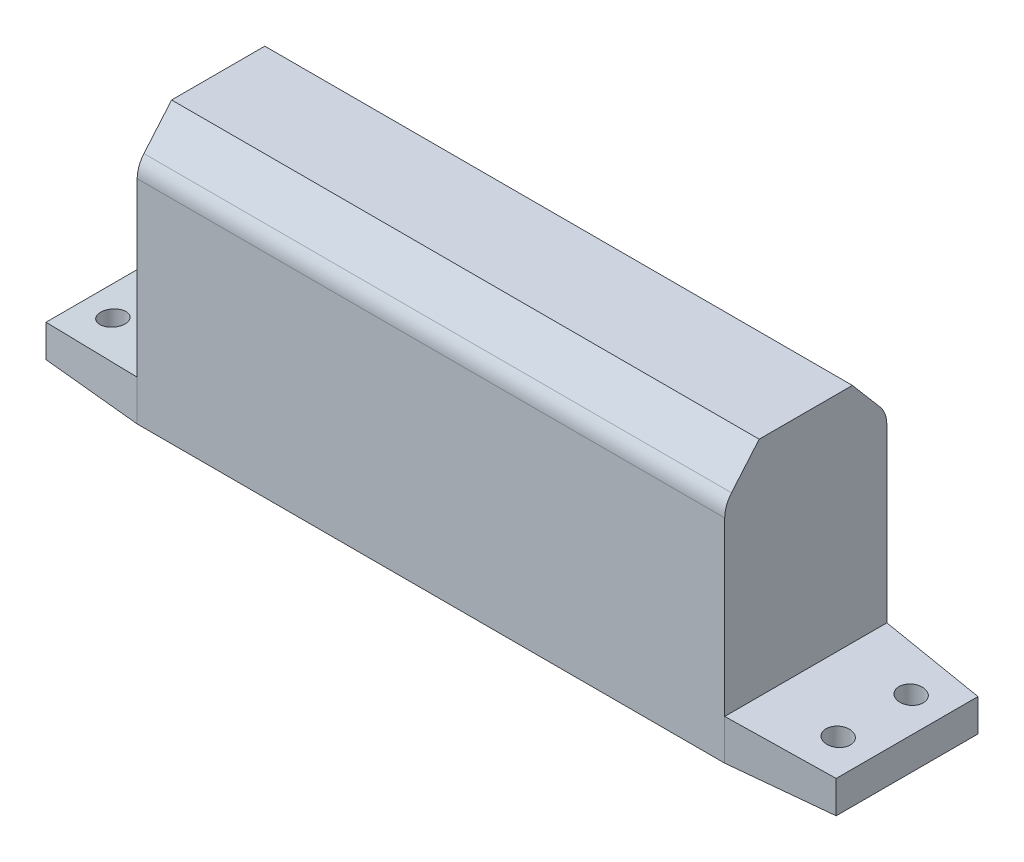
ISO-10303-21;
HEADER;
FILE_DESCRIPTION(('STEP AP214'),'2;1');
FILE_NAME('part.step','',(''),(''),'','','');
FILE_SCHEMA(('AUTOMOTIVE_DESIGN { 1 0 10303 214 1 1 1 1 }'));
ENDSEC;
DATA;
#1=APPLICATION_CONTEXT('core data for automotive mechanical design processes');
#2=APPLICATION_PROTOCOL_DEFINITION('international standard','automotive_design',2000,#1);
#3=PRODUCT_CONTEXT('',#1,'mechanical');
#4=PRODUCT('Part','Part','',(#3));
#5=PRODUCT_RELATED_PRODUCT_CATEGORY('part','',(#4));
#6=PRODUCT_DEFINITION_FORMATION('','',#4);
#7=PRODUCT_DEFINITION_CONTEXT('part definition',#1,'design');
#8=PRODUCT_DEFINITION('design','',#6,#7);
#9=PRODUCT_DEFINITION_SHAPE('','',#8);
#10=(LENGTH_UNIT() NAMED_UNIT(*) SI_UNIT(.MILLI.,.METRE.));
#11=(NAMED_UNIT(*) PLANE_ANGLE_UNIT() SI_UNIT($,.RADIAN.));
#12=(NAMED_UNIT(*) SI_UNIT($,.STERADIAN.) SOLID_ANGLE_UNIT());
#13=UNCERTAINTY_MEASURE_WITH_UNIT(LENGTH_MEASURE(1.E-05),#10,'distance_accuracy_value','');
#14=(GEOMETRIC_REPRESENTATION_CONTEXT(3) GLOBAL_UNCERTAINTY_ASSIGNED_CONTEXT((#13)) GLOBAL_UNIT_ASSIGNED_CONTEXT((#10,
#11,#12)) REPRESENTATION_CONTEXT('',''));
#15=CARTESIAN_POINT('',(0.,0.,0.));
#16=DIRECTION('',(0.,0.,1.));
#17=DIRECTION('',(1.,0.,0.));
#18=AXIS2_PLACEMENT_3D('',#15,#16,#17);
#19=CARTESIAN_POINT('',(0.,22.5,-22.));
#20=DIRECTION('',(0.,0.,-1.));
#21=DIRECTION('',(-1.,0.,0.));
#22=AXIS2_PLACEMENT_3D('',#19,#20,#21);
#23=PLANE('',#22);
#24=CARTESIAN_POINT('',(0.,22.5,-22.));
#25=DIRECTION('',(0.,0.,-1.));
#26=DIRECTION('',(-1.,0.,0.));
#27=AXIS2_PLACEMENT_3D('',#24,#25,#26);
#28=CIRCLE('',#27,17.5);
#29=CARTESIAN_POINT('',(-17.5,22.5,-22.));
#30=VERTEX_POINT('',#29);
#31=EDGE_CURVE('E284',#30,#30,#28,.T.);
#32=ORIENTED_EDGE('',*,*,#31,.T.);
#33=EDGE_LOOP('',(#32));
#34=FACE_BOUND('',#33,.T.);
#35=DIRECTION('',(-0.5,0.866025403784439,0.));
#36=VECTOR('',#35,1.);
#37=CARTESIAN_POINT('',(-8.08290376865476,8.50000000000001,-22.));
#38=LINE('',#37,#36);
#39=CARTESIAN_POINT('',(-8.08290376865476,8.50000000000001,-22.));
#40=VERTEX_POINT('',#39);
#41=CARTESIAN_POINT('',(-16.1658075373095,22.5,-22.));
#42=VERTEX_POINT('',#41);
#43=EDGE_CURVE('E261',#40,#42,#38,.T.);
#44=ORIENTED_EDGE('',*,*,#43,.F.);
#45=DIRECTION('',(-1.,0.,0.));
#46=VECTOR('',#45,1.);
#47=CARTESIAN_POINT('',(8.08290376865477,8.50000000000001,-22.));
#48=LINE('',#47,#46);
#49=CARTESIAN_POINT('',(8.08290376865477,8.50000000000001,-22.));
#50=VERTEX_POINT('',#49);
#51=EDGE_CURVE('E242',#50,#40,#48,.T.);
#52=ORIENTED_EDGE('',*,*,#51,.F.);
#53=DIRECTION('',(-0.5,-0.866025403784439,0.));
#54=VECTOR('',#53,1.);
#55=CARTESIAN_POINT('',(16.1658075373095,22.5,-22.));
#56=LINE('',#55,#54);
#57=CARTESIAN_POINT('',(16.1658075373095,22.5,-22.));
#58=VERTEX_POINT('',#57);
#59=EDGE_CURVE('E248',#58,#50,#56,.T.);
#60=ORIENTED_EDGE('',*,*,#59,.F.);
#61=DIRECTION('',(0.5,-0.866025403784438,0.));
#62=VECTOR('',#61,1.);
#63=CARTESIAN_POINT('',(8.08290376865476,36.5,-22.));
#64=LINE('',#63,#62);
#65=CARTESIAN_POINT('',(8.08290376865476,36.5,-22.));
#66=VERTEX_POINT('',#65);
#67=EDGE_CURVE('E267',#66,#58,#64,.T.);
#68=ORIENTED_EDGE('',*,*,#67,.F.);
#69=DIRECTION('',(1.,0.,0.));
#70=VECTOR('',#69,1.);
#71=CARTESIAN_POINT('',(-8.08290376865477,36.5,-22.));
#72=LINE('',#71,#70);
#73=CARTESIAN_POINT('',(-8.08290376865477,36.5,-22.));
#74=VERTEX_POINT('',#73);
#75=EDGE_CURVE('E265',#74,#66,#72,.T.);
#76=ORIENTED_EDGE('',*,*,#75,.F.);
#77=DIRECTION('',(0.5,0.866025403784439,0.));
#78=VECTOR('',#77,1.);
#79=CARTESIAN_POINT('',(-16.1658075373095,22.5,-22.));
#80=LINE('',#79,#78);
#81=EDGE_CURVE('E263',#42,#74,#80,.T.);
#82=ORIENTED_EDGE('',*,*,#81,.F.);
#83=EDGE_LOOP('',(#44,#52,#60,#68,#76,#82));
#84=FACE_BOUND('',#83,.T.);
#85=ADVANCED_FACE('F33',(#34,#84),#23,.T.);
#86=CARTESIAN_POINT('',(0.,0.,0.));
#87=DIRECTION('',(0.,1.,0.));
#88=DIRECTION('',(0.,0.,1.));
#89=AXIS2_PLACEMENT_3D('',#86,#87,#88);
#90=PLANE('',#89);
#91=CARTESIAN_POINT('',(89.5,0.,-9.));
#92=DIRECTION('',(0.,-1.,0.));
#93=DIRECTION('',(0.,0.,1.));
#94=AXIS2_PLACEMENT_3D('',#91,#92,#93);
#95=CIRCLE('',#94,3.00000000000001);
#96=CARTESIAN_POINT('',(89.5,0.,-5.99999999999999));
#97=VERTEX_POINT('',#96);
#98=EDGE_CURVE('E288',#97,#97,#95,.T.);
#99=ORIENTED_EDGE('',*,*,#98,.F.);
#100=EDGE_LOOP('',(#99));
#101=FACE_BOUND('',#100,.T.);
#102=CARTESIAN_POINT('',(-89.5,0.,9.));
#103=DIRECTION('',(0.,-1.,0.));
#104=DIRECTION('',(0.,0.,1.));
#105=AXIS2_PLACEMENT_3D('',#102,#103,#104);
#106=CIRCLE('',#105,3.00000000000001);
#107=CARTESIAN_POINT('',(-89.5,0.,12.));
#108=VERTEX_POINT('',#107);
#109=EDGE_CURVE('E292',#108,#108,#106,.T.);
#110=ORIENTED_EDGE('',*,*,#109,.F.);
#111=EDGE_LOOP('',(#110));
#112=FACE_BOUND('',#111,.T.);
#113=CARTESIAN_POINT('',(-89.5,0.,-9.));
#114=DIRECTION('',(0.,-1.,0.));
#115=DIRECTION('',(0.,0.,-1.));
#116=AXIS2_PLACEMENT_3D('',#113,#114,#115);
#117=CIRCLE('',#116,3.00000000000001);
#118=CARTESIAN_POINT('',(-89.5,0.,-12.));
#119=VERTEX_POINT('',#118);
#120=EDGE_CURVE('E287',#119,#119,#117,.T.);
#121=ORIENTED_EDGE('',*,*,#120,.F.);
#122=EDGE_LOOP('',(#121));
#123=FACE_BOUND('',#122,.T.);
#124=CARTESIAN_POINT('',(89.5,0.,9.));
#125=DIRECTION('',(0.,-1.,0.));
#126=DIRECTION('',(0.,0.,-1.));
#127=AXIS2_PLACEMENT_3D('',#124,#125,#126);
#128=CIRCLE('',#127,3.00000000000001);
#129=CARTESIAN_POINT('',(89.5,0.,5.99999999999999));
#130=VERTEX_POINT('',#129);
#131=EDGE_CURVE('E297',#130,#130,#128,.T.);
#132=ORIENTED_EDGE('',*,*,#131,.F.);
#133=EDGE_LOOP('',(#132));
#134=FACE_BOUND('',#133,.T.);
#135=DIRECTION('',(0.,0.,-1.));
#136=VECTOR('',#135,1.);
#137=CARTESIAN_POINT('',(97.5,0.,-20.));
#138=LINE('',#137,#136);
#139=CARTESIAN_POINT('',(97.5,0.,17.5));
#140=VERTEX_POINT('',#139);
#141=CARTESIAN_POINT('',(97.5,0.,-17.5));
#142=VERTEX_POINT('',#141);
#143=EDGE_CURVE('E373',#140,#142,#138,.T.);
#144=ORIENTED_EDGE('',*,*,#143,.F.);
#145=DIRECTION('',(0.995037190209989,0.,-0.0995037190209983));
#146=VECTOR('',#145,1.);
#147=CARTESIAN_POINT('',(2.69801980198017,0.,26.9801980198019));
#148=LINE('',#147,#146);
#149=CARTESIAN_POINT('',(72.4999999999999,0.,20.));
#150=VERTEX_POINT('',#149);
#151=EDGE_CURVE('E304',#150,#140,#148,.T.);
#152=ORIENTED_EDGE('',*,*,#151,.F.);
#153=DIRECTION('',(1.,0.,0.));
#154=VECTOR('',#153,1.);
#155=CARTESIAN_POINT('',(-97.5,0.,20.));
#156=LINE('',#155,#154);
#157=CARTESIAN_POINT('',(-72.5,0.,20.));
#158=VERTEX_POINT('',#157);
#159=EDGE_CURVE('E381',#158,#150,#156,.T.);
#160=ORIENTED_EDGE('',*,*,#159,.F.);
#161=DIRECTION('',(-0.995037190209989,0.,-0.0995037190209983));
#162=VECTOR('',#161,1.);
#163=CARTESIAN_POINT('',(-2.69801980198017,0.,26.9801980198019));
#164=LINE('',#163,#162);
#165=CARTESIAN_POINT('',(-97.5,0.,17.5));
#166=VERTEX_POINT('',#165);
#167=EDGE_CURVE('E308',#158,#166,#164,.T.);
#168=ORIENTED_EDGE('',*,*,#167,.T.);
#169=DIRECTION('',(0.,0.,1.));
#170=VECTOR('',#169,1.);
#171=CARTESIAN_POINT('',(-97.5,0.,-20.));
#172=LINE('',#171,#170);
#173=CARTESIAN_POINT('',(-97.5,0.,-17.5));
#174=VERTEX_POINT('',#173);
#175=EDGE_CURVE('E378',#174,#166,#172,.T.);
#176=ORIENTED_EDGE('',*,*,#175,.F.);
#177=DIRECTION('',(-0.995037190209989,0.,0.0995037190209971));
#178=VECTOR('',#177,1.);
#179=CARTESIAN_POINT('',(-2.69801980198013,0.,-26.9801980198018));
#180=LINE('',#179,#178);
#181=CARTESIAN_POINT('',(-72.5,0.,-20.));
#182=VERTEX_POINT('',#181);
#183=EDGE_CURVE('E316',#182,#174,#180,.T.);
#184=ORIENTED_EDGE('',*,*,#183,.F.);
#185=DIRECTION('',(-1.,0.,0.));
#186=VECTOR('',#185,1.);
#187=CARTESIAN_POINT('',(-97.5,0.,-20.));
#188=LINE('',#187,#186);
#189=CARTESIAN_POINT('',(72.5,0.,-20.));
#190=VERTEX_POINT('',#189);
#191=EDGE_CURVE('E375',#190,#182,#188,.T.);
#192=ORIENTED_EDGE('',*,*,#191,.F.);
#193=DIRECTION('',(0.995037190209989,0.,0.0995037190209971));
#194=VECTOR('',#193,1.);
#195=CARTESIAN_POINT('',(2.69801980198013,0.,-26.9801980198018));
#196=LINE('',#195,#194);
#197=EDGE_CURVE('E325',#190,#142,#196,.T.);
#198=ORIENTED_EDGE('',*,*,#197,.T.);
#199=EDGE_LOOP('',(#144,#152,#160,#168,#176,#184,#192,#198));
#200=FACE_BOUND('',#199,.T.);
#201=ADVANCED_FACE('F443',(#101,#112,#123,#134,#200),#90,.F.);
#202=CARTESIAN_POINT('',(-97.5,10.,-20.));
#203=DIRECTION('',(1.,0.,0.));
#204=DIRECTION('',(0.,0.,-1.));
#205=AXIS2_PLACEMENT_3D('',#202,#203,#204);
#206=PLANE('',#205);
#207=DIRECTION('',(0.,-1.,0.));
#208=VECTOR('',#207,1.);
#209=CARTESIAN_POINT('',(-97.5,237.,17.5));
#210=LINE('',#209,#208);
#211=CARTESIAN_POINT('',(-97.5,8.00000000000001,17.5));
#212=VERTEX_POINT('',#211);
#213=EDGE_CURVE('E314',#212,#166,#210,.T.);
#214=ORIENTED_EDGE('',*,*,#213,.F.);
#215=DIRECTION('',(0.,0.,-1.));
#216=VECTOR('',#215,1.);
#217=CARTESIAN_POINT('',(-97.5,8.,217.));
#218=LINE('',#217,#216);
#219=CARTESIAN_POINT('',(-97.5,8.,-17.5));
#220=VERTEX_POINT('',#219);
#221=EDGE_CURVE('E336',#212,#220,#218,.T.);
#222=ORIENTED_EDGE('',*,*,#221,.T.);
#223=DIRECTION('',(0.,-1.,0.));
#224=VECTOR('',#223,1.);
#225=CARTESIAN_POINT('',(-97.5,237.,-17.5));
#226=LINE('',#225,#224);
#227=EDGE_CURVE('E56',#220,#174,#226,.T.);
#228=ORIENTED_EDGE('',*,*,#227,.T.);
#229=ORIENTED_EDGE('',*,*,#175,.T.);
#230=EDGE_LOOP('',(#214,#222,#228,#229));
#231=FACE_BOUND('',#230,.T.);
#232=ADVANCED_FACE('F449',(#231),#206,.F.);
#233=CARTESIAN_POINT('',(-97.5,10.,20.));
#234=DIRECTION('',(0.,0.,-1.));
#235=DIRECTION('',(-1.,0.,0.));
#236=AXIS2_PLACEMENT_3D('',#233,#234,#235);
#237=PLANE('',#236);
#238=ORIENTED_EDGE('',*,*,#159,.T.);
#239=DIRECTION('',(0.,-1.,0.));
#240=VECTOR('',#239,1.);
#241=CARTESIAN_POINT('',(72.4999999999999,237.,20.));
#242=LINE('',#241,#240);
#243=CARTESIAN_POINT('',(72.5,9.99999999999999,20.));
#244=VERTEX_POINT('',#243);
#245=EDGE_CURVE('E302',#244,#150,#242,.T.);
#246=ORIENTED_EDGE('',*,*,#245,.F.);
#247=DIRECTION('',(0.,-1.,0.));
#248=VECTOR('',#247,1.);
#249=CARTESIAN_POINT('',(72.5,65.,20.));
#250=LINE('',#249,#248);
#251=CARTESIAN_POINT('',(72.5,52.4269607954298,20.));
#252=VERTEX_POINT('',#251);
#253=EDGE_CURVE('E357',#252,#244,#250,.T.);
#254=ORIENTED_EDGE('',*,*,#253,.F.);
#255=DIRECTION('',(-1.,0.,0.));
#256=VECTOR('',#255,1.);
#257=CARTESIAN_POINT('',(-97.5,52.4269607954298,20.));
#258=LINE('',#257,#256);
#259=CARTESIAN_POINT('',(-72.5,52.4269607954298,20.));
#260=VERTEX_POINT('',#259);
#261=EDGE_CURVE('E402',#252,#260,#258,.T.);
#262=ORIENTED_EDGE('',*,*,#261,.T.);
#263=DIRECTION('',(0.,-1.,0.));
#264=VECTOR('',#263,1.);
#265=CARTESIAN_POINT('',(-72.5,65.,20.));
#266=LINE('',#265,#264);
#267=CARTESIAN_POINT('',(-72.5,10.,20.));
#268=VERTEX_POINT('',#267);
#269=EDGE_CURVE('E364',#260,#268,#266,.T.);
#270=ORIENTED_EDGE('',*,*,#269,.T.);
#271=DIRECTION('',(0.,-1.,0.));
#272=VECTOR('',#271,1.);
#273=CARTESIAN_POINT('',(-72.5,237.,20.));
#274=LINE('',#273,#272);
#275=EDGE_CURVE('E311',#268,#158,#274,.T.);
#276=ORIENTED_EDGE('',*,*,#275,.T.);
#277=EDGE_LOOP('',(#238,#246,#254,#262,#270,#276));
#278=FACE_BOUND('',#277,.T.);
#279=ADVANCED_FACE('F486',(#278),#237,.F.);
#280=CARTESIAN_POINT('',(-72.5,10.,217.));
#281=DIRECTION('',(0.0797452222828899,-0.996815278536125,0.));
#282=DIRECTION('',(0.996815278536125,0.0797452222828899,0.));
#283=AXIS2_PLACEMENT_3D('',#280,#281,#282);
#284=PLANE('',#283);
#285=CARTESIAN_POINT('',(-89.5,8.64000000000001,9.));
#286=DIRECTION('',(0.0797452222828899,-0.996815278536125,0.));
#287=DIRECTION('',(-0.996815278536125,-0.0797452222828899,0.));
#288=AXIS2_PLACEMENT_3D('',#285,#286,#287);
#289=ELLIPSE('',#288,3.00958468895628,3.00000000000001);
#290=CARTESIAN_POINT('',(-92.5,8.40000000000001,9.));
#291=VERTEX_POINT('',#290);
#292=EDGE_CURVE('E301',#291,#291,#289,.T.);
#293=ORIENTED_EDGE('',*,*,#292,.T.);
#294=EDGE_LOOP('',(#293));
#295=FACE_BOUND('',#294,.T.);
#296=CARTESIAN_POINT('',(-89.5,8.64000000000001,-9.));
#297=DIRECTION('',(0.0797452222828899,-0.996815278536125,0.));
#298=DIRECTION('',(-0.996815278536125,-0.0797452222828899,0.));
#299=AXIS2_PLACEMENT_3D('',#296,#297,#298);
#300=ELLIPSE('',#299,3.00958468895628,3.00000000000001);
#301=CARTESIAN_POINT('',(-92.5,8.40000000000001,-9.));
#302=VERTEX_POINT('',#301);
#303=EDGE_CURVE('E417',#302,#302,#300,.T.);
#304=ORIENTED_EDGE('',*,*,#303,.T.);
#305=EDGE_LOOP('',(#304));
#306=FACE_BOUND('',#305,.T.);
#307=DIRECTION('',(-0.991899501072693,-0.0793519600858154,-0.0991899501072686));
#308=VECTOR('',#307,1.);
#309=CARTESIAN_POINT('',(-53.1178669815035,11.5505706414797,21.9382133018496));
#310=LINE('',#309,#308);
#311=EDGE_CURVE('E41',#268,#212,#310,.T.);
#312=ORIENTED_EDGE('',*,*,#311,.F.);
#313=DIRECTION('',(0.,0.,1.));
#314=VECTOR('',#313,1.);
#315=CARTESIAN_POINT('',(-72.5,10.,-20.));
#316=LINE('',#315,#314);
#317=CARTESIAN_POINT('',(-72.5,9.99999999999999,-20.));
#318=VERTEX_POINT('',#317);
#319=EDGE_CURVE('E354',#318,#268,#316,.T.);
#320=ORIENTED_EDGE('',*,*,#319,.F.);
#321=DIRECTION('',(-0.991899501072693,-0.0793519600858154,0.0991899501072674));
#322=VECTOR('',#321,1.);
#323=CARTESIAN_POINT('',(-95.8175914994092,8.13459268004726,-17.6682408500591));
#324=LINE('',#323,#322);
#325=EDGE_CURVE('E410',#318,#220,#324,.T.);
#326=ORIENTED_EDGE('',*,*,#325,.T.);
#327=ORIENTED_EDGE('',*,*,#221,.F.);
#328=EDGE_LOOP('',(#312,#320,#326,#327));
#329=FACE_BOUND('',#328,.T.);
#330=ADVANCED_FACE('F422',(#295,#306,#329),#284,.F.);
#331=CARTESIAN_POINT('',(97.5,10.,-20.));
#332=DIRECTION('',(-1.,0.,0.));
#333=DIRECTION('',(0.,0.,1.));
#334=AXIS2_PLACEMENT_3D('',#331,#332,#333);
#335=PLANE('',#334);
#336=DIRECTION('',(0.,0.,-1.));
#337=VECTOR('',#336,1.);
#338=CARTESIAN_POINT('',(97.5,7.99999999999999,217.));
#339=LINE('',#338,#337);
#340=CARTESIAN_POINT('',(97.5,8.00000000000001,17.5));
#341=VERTEX_POINT('',#340);
#342=CARTESIAN_POINT('',(97.5,7.99999999999998,-17.5));
#343=VERTEX_POINT('',#342);
#344=EDGE_CURVE('E332',#341,#343,#339,.T.);
#345=ORIENTED_EDGE('',*,*,#344,.F.);
#346=DIRECTION('',(0.,-1.,0.));
#347=VECTOR('',#346,1.);
#348=CARTESIAN_POINT('',(97.5,237.,17.5));
#349=LINE('',#348,#347);
#350=EDGE_CURVE('E305',#341,#140,#349,.T.);
#351=ORIENTED_EDGE('',*,*,#350,.T.);
#352=ORIENTED_EDGE('',*,*,#143,.T.);
#353=DIRECTION('',(0.,-1.,0.));
#354=VECTOR('',#353,1.);
#355=CARTESIAN_POINT('',(97.5,237.,-17.5));
#356=LINE('',#355,#354);
#357=EDGE_CURVE('E329',#343,#142,#356,.T.);
#358=ORIENTED_EDGE('',*,*,#357,.F.);
#359=EDGE_LOOP('',(#345,#351,#352,#358));
#360=FACE_BOUND('',#359,.T.);
#361=ADVANCED_FACE('F528',(#360),#335,.F.);
#362=CARTESIAN_POINT('',(-97.5,10.,-20.));
#363=DIRECTION('',(0.,0.,1.));
#364=DIRECTION('',(1.,0.,0.));
#365=AXIS2_PLACEMENT_3D('',#362,#363,#364);
#366=PLANE('',#365);
#367=CARTESIAN_POINT('',(0.,22.5,-20.));
#368=DIRECTION('',(0.,0.,1.));
#369=DIRECTION('',(1.,0.,0.));
#370=AXIS2_PLACEMENT_3D('',#367,#368,#369);
#371=CIRCLE('',#370,17.5);
#372=CARTESIAN_POINT('',(17.5,22.5,-20.));
#373=VERTEX_POINT('',#372);
#374=EDGE_CURVE('E12',#373,#373,#371,.F.);
#375=ORIENTED_EDGE('',*,*,#374,.F.);
#376=EDGE_LOOP('',(#375));
#377=FACE_BOUND('',#376,.T.);
#378=ORIENTED_EDGE('',*,*,#191,.T.);
#379=DIRECTION('',(0.,-1.,0.));
#380=VECTOR('',#379,1.);
#381=CARTESIAN_POINT('',(-72.5,237.,-20.));
#382=LINE('',#381,#380);
#383=EDGE_CURVE('E319',#318,#182,#382,.T.);
#384=ORIENTED_EDGE('',*,*,#383,.F.);
#385=DIRECTION('',(0.,-1.,0.));
#386=VECTOR('',#385,1.);
#387=CARTESIAN_POINT('',(-72.5,65.,-20.));
#388=LINE('',#387,#386);
#389=CARTESIAN_POINT('',(-72.5,52.4269607954298,-20.));
#390=VERTEX_POINT('',#389);
#391=EDGE_CURVE('E367',#390,#318,#388,.T.);
#392=ORIENTED_EDGE('',*,*,#391,.F.);
#393=DIRECTION('',(-1.,0.,0.));
#394=VECTOR('',#393,1.);
#395=CARTESIAN_POINT('',(-97.5,52.4269607954298,-20.));
#396=LINE('',#395,#394);
#397=CARTESIAN_POINT('',(72.5,52.4269607954298,-20.));
#398=VERTEX_POINT('',#397);
#399=EDGE_CURVE('E396',#390,#398,#396,.F.);
#400=ORIENTED_EDGE('',*,*,#399,.T.);
#401=DIRECTION('',(0.,-1.,0.));
#402=VECTOR('',#401,1.);
#403=CARTESIAN_POINT('',(72.5,65.,-20.));
#404=LINE('',#403,#402);
#405=CARTESIAN_POINT('',(72.4999999999999,10.,-20.));
#406=VERTEX_POINT('',#405);
#407=EDGE_CURVE('E370',#398,#406,#404,.T.);
#408=ORIENTED_EDGE('',*,*,#407,.T.);
#409=DIRECTION('',(0.,-1.,0.));
#410=VECTOR('',#409,1.);
#411=CARTESIAN_POINT('',(72.5,237.,-20.));
#412=LINE('',#411,#410);
#413=EDGE_CURVE('E328',#406,#190,#412,.T.);
#414=ORIENTED_EDGE('',*,*,#413,.T.);
#415=EDGE_LOOP('',(#378,#384,#392,#400,#408,#414));
#416=FACE_BOUND('',#415,.T.);
#417=ADVANCED_FACE('F472',(#377,#416),#366,.F.);
#418=CARTESIAN_POINT('',(72.5,9.99999999999999,217.));
#419=DIRECTION('',(-0.0797452222828899,-0.996815278536125,0.));
#420=DIRECTION('',(0.996815278536125,-0.0797452222828899,0.));
#421=AXIS2_PLACEMENT_3D('',#418,#419,#420);
#422=PLANE('',#421);
#423=CARTESIAN_POINT('',(89.5,8.63999999999998,-9.));
#424=DIRECTION('',(-0.0797452222828899,-0.996815278536125,0.));
#425=DIRECTION('',(0.996815278536125,-0.0797452222828899,0.));
#426=AXIS2_PLACEMENT_3D('',#423,#424,#425);
#427=ELLIPSE('',#426,3.00958468895628,3.00000000000001);
#428=CARTESIAN_POINT('',(92.5,8.39999999999998,-9.));
#429=VERTEX_POINT('',#428);
#430=EDGE_CURVE('E291',#429,#429,#427,.T.);
#431=ORIENTED_EDGE('',*,*,#430,.T.);
#432=EDGE_LOOP('',(#431));
#433=FACE_BOUND('',#432,.T.);
#434=CARTESIAN_POINT('',(89.5,8.63999999999998,9.));
#435=DIRECTION('',(-0.0797452222828899,-0.996815278536125,0.));
#436=DIRECTION('',(0.996815278536125,-0.0797452222828899,0.));
#437=AXIS2_PLACEMENT_3D('',#434,#435,#436);
#438=ELLIPSE('',#437,3.00958468895628,3.00000000000001);
#439=CARTESIAN_POINT('',(92.5,8.39999999999998,9.));
#440=VERTEX_POINT('',#439);
#441=EDGE_CURVE('E300',#440,#440,#438,.T.);
#442=ORIENTED_EDGE('',*,*,#441,.T.);
#443=EDGE_LOOP('',(#442));
#444=FACE_BOUND('',#443,.T.);
#445=DIRECTION('',(0.,0.,-1.));
#446=VECTOR('',#445,1.);
#447=CARTESIAN_POINT('',(72.5,10.,-20.));
#448=LINE('',#447,#446);
#449=EDGE_CURVE('E349',#244,#406,#448,.T.);
#450=ORIENTED_EDGE('',*,*,#449,.F.);
#451=DIRECTION('',(0.991899501072693,-0.0793519600858154,-0.0991899501072686));
#452=VECTOR('',#451,1.);
#453=CARTESIAN_POINT('',(53.1178669815035,11.5505706414797,21.9382133018496));
#454=LINE('',#453,#452);
#455=EDGE_CURVE('E310',#244,#341,#454,.T.);
#456=ORIENTED_EDGE('',*,*,#455,.T.);
#457=ORIENTED_EDGE('',*,*,#344,.T.);
#458=DIRECTION('',(0.991899501072693,-0.0793519600858154,0.0991899501072674));
#459=VECTOR('',#458,1.);
#460=CARTESIAN_POINT('',(95.8175914994092,8.13459268004726,-17.6682408500591));
#461=LINE('',#460,#459);
#462=EDGE_CURVE('E407',#406,#343,#461,.T.);
#463=ORIENTED_EDGE('',*,*,#462,.F.);
#464=EDGE_LOOP('',(#450,#456,#457,#463));
#465=FACE_BOUND('',#464,.T.);
#466=ADVANCED_FACE('F468',(#433,#444,#465),#422,.F.);
#467=CARTESIAN_POINT('',(72.5,65.,-20.));
#468=DIRECTION('',(-1.,0.,0.));
#469=DIRECTION('',(0.,0.,1.));
#470=AXIS2_PLACEMENT_3D('',#467,#468,#469);
#471=PLANE('',#470);
#472=ORIENTED_EDGE('',*,*,#407,.F.);
#473=CARTESIAN_POINT('',(72.5,52.4269607954298,-13.));
#474=DIRECTION('',(-1.,0.,0.));
#475=DIRECTION('',(0.,0.,1.));
#476=AXIS2_PLACEMENT_3D('',#473,#474,#475);
#477=CIRCLE('',#476,7.);
#478=CARTESIAN_POINT('',(72.5,56.9604997360986,-18.3335752243162));
#479=VERTEX_POINT('',#478);
#480=EDGE_CURVE('E400',#398,#479,#477,.F.);
#481=ORIENTED_EDGE('',*,*,#480,.T.);
#482=DIRECTION('',(0.,0.761939317759459,0.647648420095541));
#483=VECTOR('',#482,1.);
#484=CARTESIAN_POINT('',(72.5,60.8055152394775,-15.0653120464441));
#485=LINE('',#484,#483);
#486=CARTESIAN_POINT('',(72.5,65.,-11.5));
#487=VERTEX_POINT('',#486);
#488=EDGE_CURVE('E347',#479,#487,#485,.T.);
#489=ORIENTED_EDGE('',*,*,#488,.T.);
#490=DIRECTION('',(0.,0.,-1.));
#491=VECTOR('',#490,1.);
#492=CARTESIAN_POINT('',(72.5,65.,-20.));
#493=LINE('',#492,#491);
#494=CARTESIAN_POINT('',(72.5,65.,11.5));
#495=VERTEX_POINT('',#494);
#496=EDGE_CURVE('E350',#495,#487,#493,.T.);
#497=ORIENTED_EDGE('',*,*,#496,.F.);
#498=DIRECTION('',(0.,-0.761939317759459,0.647648420095541));
#499=VECTOR('',#498,1.);
#500=CARTESIAN_POINT('',(72.5,80.544267053701,-1.71262699564591));
#501=LINE('',#500,#499);
#502=CARTESIAN_POINT('',(72.5,56.9604997360986,18.3335752243162));
#503=VERTEX_POINT('',#502);
#504=EDGE_CURVE('E342',#495,#503,#501,.T.);
#505=ORIENTED_EDGE('',*,*,#504,.T.);
#506=CARTESIAN_POINT('',(72.5,52.4269607954298,13.));
#507=DIRECTION('',(-1.,0.,0.));
#508=DIRECTION('',(0.,0.,1.));
#509=AXIS2_PLACEMENT_3D('',#506,#507,#508);
#510=CIRCLE('',#509,7.);
#511=EDGE_CURVE('E398',#503,#252,#510,.F.);
#512=ORIENTED_EDGE('',*,*,#511,.T.);
#513=ORIENTED_EDGE('',*,*,#253,.T.);
#514=ORIENTED_EDGE('',*,*,#449,.T.);
#515=EDGE_LOOP('',(#472,#481,#489,#497,#505,#512,#513,#514));
#516=FACE_BOUND('',#515,.T.);
#517=ADVANCED_FACE('F471',(#516),#471,.F.);
#518=CARTESIAN_POINT('',(-72.5,65.,-20.));
#519=DIRECTION('',(1.,0.,0.));
#520=DIRECTION('',(0.,0.,-1.));
#521=AXIS2_PLACEMENT_3D('',#518,#519,#520);
#522=PLANE('',#521);
#523=DIRECTION('',(0.,0.761939317759459,0.647648420095541));
#524=VECTOR('',#523,1.);
#525=CARTESIAN_POINT('',(-72.5,65.,-11.5));
#526=LINE('',#525,#524);
#527=CARTESIAN_POINT('',(-72.5,56.9604997360986,-18.3335752243162));
#528=VERTEX_POINT('',#527);
#529=CARTESIAN_POINT('',(-72.5,65.,-11.5));
#530=VERTEX_POINT('',#529);
#531=EDGE_CURVE('E345',#528,#530,#526,.T.);
#532=ORIENTED_EDGE('',*,*,#531,.F.);
#533=CARTESIAN_POINT('',(-72.5,52.4269607954298,-13.));
#534=DIRECTION('',(1.,0.,0.));
#535=DIRECTION('',(0.,0.,-1.));
#536=AXIS2_PLACEMENT_3D('',#533,#534,#535);
#537=CIRCLE('',#536,7.);
#538=EDGE_CURVE('E394',#528,#390,#537,.F.);
#539=ORIENTED_EDGE('',*,*,#538,.T.);
#540=ORIENTED_EDGE('',*,*,#391,.T.);
#541=ORIENTED_EDGE('',*,*,#319,.T.);
#542=ORIENTED_EDGE('',*,*,#269,.F.);
#543=CARTESIAN_POINT('',(-72.5,52.4269607954298,13.));
#544=DIRECTION('',(1.,0.,0.));
#545=DIRECTION('',(0.,0.,-1.));
#546=AXIS2_PLACEMENT_3D('',#543,#544,#545);
#547=CIRCLE('',#546,7.);
#548=CARTESIAN_POINT('',(-72.5,56.9604997360986,18.3335752243162));
#549=VERTEX_POINT('',#548);
#550=EDGE_CURVE('E392',#260,#549,#547,.F.);
#551=ORIENTED_EDGE('',*,*,#550,.T.);
#552=DIRECTION('',(0.,-0.761939317759459,0.647648420095541));
#553=VECTOR('',#552,1.);
#554=CARTESIAN_POINT('',(-72.5,65.,11.5));
#555=LINE('',#554,#553);
#556=CARTESIAN_POINT('',(-72.5,65.,11.5));
#557=VERTEX_POINT('',#556);
#558=EDGE_CURVE('E339',#557,#549,#555,.T.);
#559=ORIENTED_EDGE('',*,*,#558,.F.);
#560=DIRECTION('',(0.,0.,1.));
#561=VECTOR('',#560,1.);
#562=CARTESIAN_POINT('',(-72.5,65.,-20.));
#563=LINE('',#562,#561);
#564=EDGE_CURVE('E353',#530,#557,#563,.T.);
#565=ORIENTED_EDGE('',*,*,#564,.F.);
#566=EDGE_LOOP('',(#532,#539,#540,#541,#542,#551,#559,#565));
#567=FACE_BOUND('',#566,.T.);
#568=ADVANCED_FACE('F493',(#567),#522,.F.);
#569=CARTESIAN_POINT('',(0.,65.,0.));
#570=DIRECTION('',(0.,1.,0.));
#571=DIRECTION('',(0.,0.,1.));
#572=AXIS2_PLACEMENT_3D('',#569,#570,#571);
#573=PLANE('',#572);
#574=DIRECTION('',(-1.,0.,0.));
#575=VECTOR('',#574,1.);
#576=CARTESIAN_POINT('',(0.,65.,11.5));
#577=LINE('',#576,#575);
#578=EDGE_CURVE('E387',#495,#557,#577,.T.);
#579=ORIENTED_EDGE('',*,*,#578,.F.);
#580=ORIENTED_EDGE('',*,*,#496,.T.);
#581=DIRECTION('',(1.,0.,0.));
#582=VECTOR('',#581,1.);
#583=CARTESIAN_POINT('',(0.,65.,-11.5));
#584=LINE('',#583,#582);
#585=EDGE_CURVE('E384',#530,#487,#584,.T.);
#586=ORIENTED_EDGE('',*,*,#585,.F.);
#587=ORIENTED_EDGE('',*,*,#564,.T.);
#588=EDGE_LOOP('',(#579,#580,#586,#587));
#589=FACE_BOUND('',#588,.T.);
#590=ADVANCED_FACE('F500',(#589),#573,.T.);
#591=CARTESIAN_POINT('',(164.5,65.,-11.5));
#592=DIRECTION('',(0.,-0.647648420095541,0.761939317759459));
#593=DIRECTION('',(0.,-0.761939317759459,-0.647648420095541));
#594=AXIS2_PLACEMENT_3D('',#591,#592,#593);
#595=PLANE('',#594);
#596=ORIENTED_EDGE('',*,*,#488,.F.);
#597=DIRECTION('',(-1.,0.,0.));
#598=VECTOR('',#597,1.);
#599=CARTESIAN_POINT('',(164.5,56.9604997360986,-18.3335752243162));
#600=LINE('',#599,#598);
#601=EDGE_CURVE('E389',#479,#528,#600,.T.);
#602=ORIENTED_EDGE('',*,*,#601,.T.);
#603=ORIENTED_EDGE('',*,*,#531,.T.);
#604=ORIENTED_EDGE('',*,*,#585,.T.);
#605=EDGE_LOOP('',(#596,#602,#603,#604));
#606=FACE_BOUND('',#605,.T.);
#607=ADVANCED_FACE('F506',(#606),#595,.F.);
#608=CARTESIAN_POINT('',(164.5,65.,11.5));
#609=DIRECTION('',(0.,-0.647648420095541,-0.761939317759459));
#610=DIRECTION('',(0.,0.761939317759459,-0.647648420095541));
#611=AXIS2_PLACEMENT_3D('',#608,#609,#610);
#612=PLANE('',#611);
#613=ORIENTED_EDGE('',*,*,#558,.T.);
#614=DIRECTION('',(-1.,0.,0.));
#615=VECTOR('',#614,1.);
#616=CARTESIAN_POINT('',(164.5,56.9604997360986,18.3335752243162));
#617=LINE('',#616,#615);
#618=EDGE_CURVE('E405',#549,#503,#617,.F.);
#619=ORIENTED_EDGE('',*,*,#618,.T.);
#620=ORIENTED_EDGE('',*,*,#504,.F.);
#621=ORIENTED_EDGE('',*,*,#578,.T.);
#622=EDGE_LOOP('',(#613,#619,#620,#621));
#623=FACE_BOUND('',#622,.T.);
#624=ADVANCED_FACE('F496',(#623),#612,.F.);
#625=CARTESIAN_POINT('',(164.5,52.4269607954298,-13.));
#626=DIRECTION('',(-1.,0.,0.));
#627=DIRECTION('',(0.,0.,1.));
#628=AXIS2_PLACEMENT_3D('',#625,#626,#627);
#629=CYLINDRICAL_SURFACE('',#628,7.);
#630=ORIENTED_EDGE('',*,*,#480,.F.);
#631=ORIENTED_EDGE('',*,*,#399,.F.);
#632=ORIENTED_EDGE('',*,*,#538,.F.);
#633=ORIENTED_EDGE('',*,*,#601,.F.);
#634=EDGE_LOOP('',(#630,#631,#632,#633));
#635=FACE_BOUND('',#634,.T.);
#636=ADVANCED_FACE('F508',(#635),#629,.T.);
#637=CARTESIAN_POINT('',(-97.5,52.4269607954298,13.));
#638=DIRECTION('',(-1.,0.,0.));
#639=DIRECTION('',(0.,0.,1.));
#640=AXIS2_PLACEMENT_3D('',#637,#638,#639);
#641=CYLINDRICAL_SURFACE('',#640,7.);
#642=ORIENTED_EDGE('',*,*,#511,.F.);
#643=ORIENTED_EDGE('',*,*,#618,.F.);
#644=ORIENTED_EDGE('',*,*,#550,.F.);
#645=ORIENTED_EDGE('',*,*,#261,.F.);
#646=EDGE_LOOP('',(#642,#643,#644,#645));
#647=FACE_BOUND('',#646,.T.);
#648=ADVANCED_FACE('F35',(#647),#641,.T.);
#649=CARTESIAN_POINT('',(2.69801980198013,237.,-26.9801980198018));
#650=DIRECTION('',(0.0995037190209971,0.,-0.995037190209989));
#651=DIRECTION('',(-0.995037190209989,0.,-0.0995037190209971));
#652=AXIS2_PLACEMENT_3D('',#649,#650,#651);
#653=PLANE('',#652);
#654=ORIENTED_EDGE('',*,*,#462,.T.);
#655=ORIENTED_EDGE('',*,*,#357,.T.);
#656=ORIENTED_EDGE('',*,*,#197,.F.);
#657=ORIENTED_EDGE('',*,*,#413,.F.);
#658=EDGE_LOOP('',(#654,#655,#656,#657));
#659=FACE_BOUND('',#658,.T.);
#660=ADVANCED_FACE('F531',(#659),#653,.T.);
#661=CARTESIAN_POINT('',(-2.69801980198013,237.,-26.9801980198018));
#662=DIRECTION('',(0.0995037190209971,0.,0.995037190209989));
#663=DIRECTION('',(0.995037190209989,0.,-0.0995037190209971));
#664=AXIS2_PLACEMENT_3D('',#661,#662,#663);
#665=PLANE('',#664);
#666=ORIENTED_EDGE('',*,*,#383,.T.);
#667=ORIENTED_EDGE('',*,*,#183,.T.);
#668=ORIENTED_EDGE('',*,*,#227,.F.);
#669=ORIENTED_EDGE('',*,*,#325,.F.);
#670=EDGE_LOOP('',(#666,#667,#668,#669));
#671=FACE_BOUND('',#670,.T.);
#672=ADVANCED_FACE('F532',(#671),#665,.F.);
#673=CARTESIAN_POINT('',(-2.69801980198017,237.,26.9801980198019));
#674=DIRECTION('',(-0.0995037190209983,0.,0.995037190209989));
#675=DIRECTION('',(0.995037190209989,0.,0.0995037190209983));
#676=AXIS2_PLACEMENT_3D('',#673,#674,#675);
#677=PLANE('',#676);
#678=ORIENTED_EDGE('',*,*,#311,.T.);
#679=ORIENTED_EDGE('',*,*,#213,.T.);
#680=ORIENTED_EDGE('',*,*,#167,.F.);
#681=ORIENTED_EDGE('',*,*,#275,.F.);
#682=EDGE_LOOP('',(#678,#679,#680,#681));
#683=FACE_BOUND('',#682,.T.);
#684=ADVANCED_FACE('F534',(#683),#677,.T.);
#685=CARTESIAN_POINT('',(2.69801980198017,237.,26.9801980198019));
#686=DIRECTION('',(-0.0995037190209983,0.,-0.995037190209989));
#687=DIRECTION('',(-0.995037190209989,0.,0.0995037190209983));
#688=AXIS2_PLACEMENT_3D('',#685,#686,#687);
#689=PLANE('',#688);
#690=ORIENTED_EDGE('',*,*,#245,.T.);
#691=ORIENTED_EDGE('',*,*,#151,.T.);
#692=ORIENTED_EDGE('',*,*,#350,.F.);
#693=ORIENTED_EDGE('',*,*,#455,.F.);
#694=EDGE_LOOP('',(#690,#691,#692,#693));
#695=FACE_BOUND('',#694,.T.);
#696=ADVANCED_FACE('F461',(#695),#689,.F.);
#697=CARTESIAN_POINT('',(89.5,237.,9.));
#698=DIRECTION('',(0.,-1.,0.));
#699=DIRECTION('',(0.,0.,-1.));
#700=AXIS2_PLACEMENT_3D('',#697,#698,#699);
#701=CYLINDRICAL_SURFACE('',#700,3.00000000000001);
#702=ORIENTED_EDGE('',*,*,#131,.T.);
#703=EDGE_LOOP('',(#702));
#704=FACE_BOUND('',#703,.T.);
#705=ORIENTED_EDGE('',*,*,#441,.F.);
#706=EDGE_LOOP('',(#705));
#707=FACE_BOUND('',#706,.T.);
#708=ADVANCED_FACE('F456',(#704,#707),#701,.F.);
#709=CARTESIAN_POINT('',(89.5,237.,-9.));
#710=DIRECTION('',(0.,-1.,0.));
#711=DIRECTION('',(0.,0.,-1.));
#712=AXIS2_PLACEMENT_3D('',#709,#710,#711);
#713=CYLINDRICAL_SURFACE('',#712,3.00000000000001);
#714=ORIENTED_EDGE('',*,*,#98,.T.);
#715=EDGE_LOOP('',(#714));
#716=FACE_BOUND('',#715,.T.);
#717=ORIENTED_EDGE('',*,*,#430,.F.);
#718=EDGE_LOOP('',(#717));
#719=FACE_BOUND('',#718,.T.);
#720=ADVANCED_FACE('F438',(#716,#719),#713,.F.);
#721=CARTESIAN_POINT('',(-89.5,237.,-9.));
#722=DIRECTION('',(0.,-1.,0.));
#723=DIRECTION('',(0.,0.,-1.));
#724=AXIS2_PLACEMENT_3D('',#721,#722,#723);
#725=CYLINDRICAL_SURFACE('',#724,3.00000000000001);
#726=ORIENTED_EDGE('',*,*,#120,.T.);
#727=EDGE_LOOP('',(#726));
#728=FACE_BOUND('',#727,.T.);
#729=ORIENTED_EDGE('',*,*,#303,.F.);
#730=EDGE_LOOP('',(#729));
#731=FACE_BOUND('',#730,.T.);
#732=ADVANCED_FACE('F428',(#728,#731),#725,.F.);
#733=CARTESIAN_POINT('',(-89.5,237.,9.));
#734=DIRECTION('',(0.,-1.,0.));
#735=DIRECTION('',(0.,0.,-1.));
#736=AXIS2_PLACEMENT_3D('',#733,#734,#735);
#737=CYLINDRICAL_SURFACE('',#736,3.00000000000001);
#738=ORIENTED_EDGE('',*,*,#109,.T.);
#739=EDGE_LOOP('',(#738));
#740=FACE_BOUND('',#739,.T.);
#741=ORIENTED_EDGE('',*,*,#292,.F.);
#742=EDGE_LOOP('',(#741));
#743=FACE_BOUND('',#742,.T.);
#744=ADVANCED_FACE('F425',(#740,#743),#737,.F.);
#745=CARTESIAN_POINT('',(0.,22.5,-22.));
#746=DIRECTION('',(0.,0.,1.));
#747=DIRECTION('',(1.,0.,0.));
#748=AXIS2_PLACEMENT_3D('',#745,#746,#747);
#749=CYLINDRICAL_SURFACE('',#748,17.5);
#750=ORIENTED_EDGE('',*,*,#31,.F.);
#751=EDGE_LOOP('',(#750));
#752=FACE_BOUND('',#751,.T.);
#753=ORIENTED_EDGE('',*,*,#374,.T.);
#754=EDGE_LOOP('',(#753));
#755=FACE_BOUND('',#754,.T.);
#756=ADVANCED_FACE('F427',(#752,#755),#749,.T.);
#757=CARTESIAN_POINT('',(8.08290376865477,8.50000000000001,-28.));
#758=DIRECTION('',(0.,1.,0.));
#759=DIRECTION('',(0.,0.,1.));
#760=AXIS2_PLACEMENT_3D('',#757,#758,#759);
#761=PLANE('',#760);
#762=ORIENTED_EDGE('',*,*,#51,.T.);
#763=DIRECTION('',(0.,0.,1.));
#764=VECTOR('',#763,1.);
#765=CARTESIAN_POINT('',(-8.08290376865476,8.50000000000001,-28.));
#766=LINE('',#765,#764);
#767=CARTESIAN_POINT('',(-8.08290376865476,8.50000000000001,-28.));
#768=VERTEX_POINT('',#767);
#769=EDGE_CURVE('E282',#768,#40,#766,.T.);
#770=ORIENTED_EDGE('',*,*,#769,.F.);
#771=DIRECTION('',(-1.,0.,0.));
#772=VECTOR('',#771,1.);
#773=CARTESIAN_POINT('',(8.08290376865477,8.50000000000001,-28.));
#774=LINE('',#773,#772);
#775=CARTESIAN_POINT('',(8.08290376865477,8.50000000000001,-28.));
#776=VERTEX_POINT('',#775);
#777=EDGE_CURVE('E244',#776,#768,#774,.T.);
#778=ORIENTED_EDGE('',*,*,#777,.F.);
#779=DIRECTION('',(0.,0.,1.));
#780=VECTOR('',#779,1.);
#781=CARTESIAN_POINT('',(8.08290376865477,8.50000000000001,-28.));
#782=LINE('',#781,#780);
#783=EDGE_CURVE('E258',#776,#50,#782,.T.);
#784=ORIENTED_EDGE('',*,*,#783,.T.);
#785=EDGE_LOOP('',(#762,#770,#778,#784));
#786=FACE_BOUND('',#785,.T.);
#787=ADVANCED_FACE('F435',(#786),#761,.F.);
#788=CARTESIAN_POINT('',(-8.08290376865476,8.50000000000001,-28.));
#789=DIRECTION('',(0.866025403784438,0.5,0.));
#790=DIRECTION('',(-0.5,0.866025403784439,0.));
#791=AXIS2_PLACEMENT_3D('',#788,#789,#790);
#792=PLANE('',#791);
#793=ORIENTED_EDGE('',*,*,#43,.T.);
#794=DIRECTION('',(0.,0.,1.));
#795=VECTOR('',#794,1.);
#796=CARTESIAN_POINT('',(-16.1658075373095,22.5,-28.));
#797=LINE('',#796,#795);
#798=CARTESIAN_POINT('',(-16.1658075373095,22.5,-28.));
#799=VERTEX_POINT('',#798);
#800=EDGE_CURVE('E279',#799,#42,#797,.T.);
#801=ORIENTED_EDGE('',*,*,#800,.F.);
#802=DIRECTION('',(-0.5,0.866025403784439,0.));
#803=VECTOR('',#802,1.);
#804=CARTESIAN_POINT('',(-8.08290376865476,8.50000000000001,-28.));
#805=LINE('',#804,#803);
#806=EDGE_CURVE('E247',#768,#799,#805,.T.);
#807=ORIENTED_EDGE('',*,*,#806,.F.);
#808=ORIENTED_EDGE('',*,*,#769,.T.);
#809=EDGE_LOOP('',(#793,#801,#807,#808));
#810=FACE_BOUND('',#809,.T.);
#811=ADVANCED_FACE('F659',(#810),#792,.F.);
#812=CARTESIAN_POINT('',(-16.1658075373095,22.5,-28.));
#813=DIRECTION('',(0.866025403784439,-0.5,0.));
#814=DIRECTION('',(0.5,0.866025403784439,0.));
#815=AXIS2_PLACEMENT_3D('',#812,#813,#814);
#816=PLANE('',#815);
#817=ORIENTED_EDGE('',*,*,#81,.T.);
#818=DIRECTION('',(0.,0.,1.));
#819=VECTOR('',#818,1.);
#820=CARTESIAN_POINT('',(-8.08290376865477,36.5,-28.));
#821=LINE('',#820,#819);
#822=CARTESIAN_POINT('',(-8.08290376865477,36.5,-28.));
#823=VERTEX_POINT('',#822);
#824=EDGE_CURVE('E276',#823,#74,#821,.T.);
#825=ORIENTED_EDGE('',*,*,#824,.F.);
#826=DIRECTION('',(0.5,0.866025403784439,0.));
#827=VECTOR('',#826,1.);
#828=CARTESIAN_POINT('',(-16.1658075373095,22.5,-28.));
#829=LINE('',#828,#827);
#830=EDGE_CURVE('E250',#799,#823,#829,.T.);
#831=ORIENTED_EDGE('',*,*,#830,.F.);
#832=ORIENTED_EDGE('',*,*,#800,.T.);
#833=EDGE_LOOP('',(#817,#825,#831,#832));
#834=FACE_BOUND('',#833,.T.);
#835=ADVANCED_FACE('F668',(#834),#816,.F.);
#836=CARTESIAN_POINT('',(-8.08290376865477,36.5,-28.));
#837=DIRECTION('',(0.,-1.,0.));
#838=DIRECTION('',(1.,0.,0.));
#839=AXIS2_PLACEMENT_3D('',#836,#837,#838);
#840=PLANE('',#839);
#841=ORIENTED_EDGE('',*,*,#75,.T.);
#842=DIRECTION('',(0.,0.,1.));
#843=VECTOR('',#842,1.);
#844=CARTESIAN_POINT('',(8.08290376865476,36.5,-28.));
#845=LINE('',#844,#843);
#846=CARTESIAN_POINT('',(8.08290376865476,36.5,-28.));
#847=VERTEX_POINT('',#846);
#848=EDGE_CURVE('E273',#847,#66,#845,.T.);
#849=ORIENTED_EDGE('',*,*,#848,.F.);
#850=DIRECTION('',(1.,0.,0.));
#851=VECTOR('',#850,1.);
#852=CARTESIAN_POINT('',(-8.08290376865477,36.5,-28.));
#853=LINE('',#852,#851);
#854=EDGE_CURVE('E252',#823,#847,#853,.T.);
#855=ORIENTED_EDGE('',*,*,#854,.F.);
#856=ORIENTED_EDGE('',*,*,#824,.T.);
#857=EDGE_LOOP('',(#841,#849,#855,#856));
#858=FACE_BOUND('',#857,.T.);
#859=ADVANCED_FACE('F677',(#858),#840,.F.);
#860=CARTESIAN_POINT('',(8.08290376865476,36.5,-28.));
#861=DIRECTION('',(-0.866025403784438,-0.5,0.));
#862=DIRECTION('',(0.5,-0.866025403784439,0.));
#863=AXIS2_PLACEMENT_3D('',#860,#861,#862);
#864=PLANE('',#863);
#865=ORIENTED_EDGE('',*,*,#67,.T.);
#866=DIRECTION('',(0.,0.,1.));
#867=VECTOR('',#866,1.);
#868=CARTESIAN_POINT('',(16.1658075373095,22.5,-28.));
#869=LINE('',#868,#867);
#870=CARTESIAN_POINT('',(16.1658075373095,22.5,-28.));
#871=VERTEX_POINT('',#870);
#872=EDGE_CURVE('E48',#871,#58,#869,.T.);
#873=ORIENTED_EDGE('',*,*,#872,.F.);
#874=DIRECTION('',(0.5,-0.866025403784438,0.));
#875=VECTOR('',#874,1.);
#876=CARTESIAN_POINT('',(8.08290376865476,36.5,-28.));
#877=LINE('',#876,#875);
#878=EDGE_CURVE('E254',#847,#871,#877,.T.);
#879=ORIENTED_EDGE('',*,*,#878,.F.);
#880=ORIENTED_EDGE('',*,*,#848,.T.);
#881=EDGE_LOOP('',(#865,#873,#879,#880));
#882=FACE_BOUND('',#881,.T.);
#883=ADVANCED_FACE('F687',(#882),#864,.F.);
#884=CARTESIAN_POINT('',(16.1658075373095,22.5,-28.));
#885=DIRECTION('',(-0.866025403784439,0.5,0.));
#886=DIRECTION('',(-0.5,-0.866025403784439,0.));
#887=AXIS2_PLACEMENT_3D('',#884,#885,#886);
#888=PLANE('',#887);
#889=ORIENTED_EDGE('',*,*,#59,.T.);
#890=ORIENTED_EDGE('',*,*,#783,.F.);
#891=DIRECTION('',(-0.5,-0.866025403784439,0.));
#892=VECTOR('',#891,1.);
#893=CARTESIAN_POINT('',(16.1658075373095,22.5,-28.));
#894=LINE('',#893,#892);
#895=EDGE_CURVE('E256',#871,#776,#894,.T.);
#896=ORIENTED_EDGE('',*,*,#895,.F.);
#897=ORIENTED_EDGE('',*,*,#872,.T.);
#898=EDGE_LOOP('',(#889,#890,#896,#897));
#899=FACE_BOUND('',#898,.T.);
#900=ADVANCED_FACE('F697',(#899),#888,.F.);
#901=CARTESIAN_POINT('',(0.,0.,-28.));
#902=DIRECTION('',(0.,0.,-1.));
#903=DIRECTION('',(-1.,0.,0.));
#904=AXIS2_PLACEMENT_3D('',#901,#902,#903);
#905=PLANE('',#904);
#906=CARTESIAN_POINT('',(0.,22.5,-28.));
#907=DIRECTION('',(0.,0.,-1.));
#908=DIRECTION('',(-1.,0.,0.));
#909=AXIS2_PLACEMENT_3D('',#906,#907,#908);
#910=CIRCLE('',#909,4.5);
#911=CARTESIAN_POINT('',(-4.5,22.5,-28.));
#912=VERTEX_POINT('',#911);
#913=EDGE_CURVE('E232',#912,#912,#910,.T.);
#914=ORIENTED_EDGE('',*,*,#913,.F.);
#915=EDGE_LOOP('',(#914));
#916=FACE_BOUND('',#915,.T.);
#917=ORIENTED_EDGE('',*,*,#777,.T.);
#918=ORIENTED_EDGE('',*,*,#806,.T.);
#919=ORIENTED_EDGE('',*,*,#830,.T.);
#920=ORIENTED_EDGE('',*,*,#854,.T.);
#921=ORIENTED_EDGE('',*,*,#878,.T.);
#922=ORIENTED_EDGE('',*,*,#895,.T.);
#923=EDGE_LOOP('',(#917,#918,#919,#920,#921,#922));
#924=FACE_BOUND('',#923,.T.);
#925=ADVANCED_FACE('F707',(#916,#924),#905,.T.);
#926=CARTESIAN_POINT('',(0.,22.5,-38.));
#927=DIRECTION('',(0.,0.,1.));
#928=DIRECTION('',(1.,0.,0.));
#929=AXIS2_PLACEMENT_3D('',#926,#927,#928);
#930=CYLINDRICAL_SURFACE('',#929,4.5);
#931=CARTESIAN_POINT('',(0.,22.5,-38.));
#932=DIRECTION('',(0.,0.,-1.));
#933=DIRECTION('',(-1.,0.,0.));
#934=AXIS2_PLACEMENT_3D('',#931,#932,#933);
#935=CIRCLE('',#934,4.5);
#936=CARTESIAN_POINT('',(-4.5,22.5,-38.));
#937=VERTEX_POINT('',#936);
#938=EDGE_CURVE('E235',#937,#937,#935,.T.);
#939=ORIENTED_EDGE('',*,*,#938,.F.);
#940=EDGE_LOOP('',(#939));
#941=FACE_BOUND('',#940,.T.);
#942=ORIENTED_EDGE('',*,*,#913,.T.);
#943=EDGE_LOOP('',(#942));
#944=FACE_BOUND('',#943,.T.);
#945=ADVANCED_FACE('F716',(#941,#944),#930,.T.);
#946=CARTESIAN_POINT('',(4.33540235204422,17.571536027591,-43.));
#947=DIRECTION('',(-0.196579212351057,0.98048794652022,0.));
#948=DIRECTION('',(-0.98048794652022,-0.196579212351057,0.));
#949=AXIS2_PLACEMENT_3D('',#946,#947,#948);
#950=PLANE('',#949);
#951=DIRECTION('',(-0.98048794652022,-0.196579212351057,0.));
#952=VECTOR('',#951,1.);
#953=CARTESIAN_POINT('',(4.33540235204422,17.571536027591,-38.));
#954=LINE('',#953,#952);
#955=CARTESIAN_POINT('',(4.33540235204422,17.571536027591,-38.));
#956=VERTEX_POINT('',#955);
#957=CARTESIAN_POINT('',(-2.10047382572048,16.2811994412984,-38.));
#958=VERTEX_POINT('',#957);
#959=EDGE_CURVE('E231',#956,#958,#954,.T.);
#960=ORIENTED_EDGE('',*,*,#959,.T.);
#961=DIRECTION('',(0.,0.,1.));
#962=VECTOR('',#961,1.);
#963=CARTESIAN_POINT('',(-2.10047382572048,16.2811994412984,-43.));
#964=LINE('',#963,#962);
#965=CARTESIAN_POINT('',(-2.10047382572048,16.2811994412984,-43.));
#966=VERTEX_POINT('',#965);
#967=EDGE_CURVE('E211',#966,#958,#964,.T.);
#968=ORIENTED_EDGE('',*,*,#967,.F.);
#969=DIRECTION('',(-0.98048794652022,-0.196579212351057,0.));
#970=VECTOR('',#969,1.);
#971=CARTESIAN_POINT('',(4.33540235204422,17.571536027591,-43.));
#972=LINE('',#971,#970);
#973=CARTESIAN_POINT('',(4.33540235204422,17.571536027591,-43.));
#974=VERTEX_POINT('',#973);
#975=EDGE_CURVE('E218',#974,#966,#972,.T.);
#976=ORIENTED_EDGE('',*,*,#975,.F.);
#977=DIRECTION('',(0.,0.,1.));
#978=VECTOR('',#977,1.);
#979=CARTESIAN_POINT('',(4.33540235204422,17.571536027591,-43.));
#980=LINE('',#979,#978);
#981=EDGE_CURVE('E822',#974,#956,#980,.T.);
#982=ORIENTED_EDGE('',*,*,#981,.T.);
#983=EDGE_LOOP('',(#960,#968,#976,#982));
#984=FACE_BOUND('',#983,.T.);
#985=ADVANCED_FACE('F229',(#984),#950,.F.);
#986=CARTESIAN_POINT('',(-2.10047382572048,16.2811994412984,-43.));
#987=DIRECTION('',(0.75083786361542,0.660486565012061,0.));
#988=DIRECTION('',(-0.660486565012061,0.75083786361542,0.));
#989=AXIS2_PLACEMENT_3D('',#986,#987,#988);
#990=PLANE('',#989);
#991=DIRECTION('',(-0.660486565012061,0.75083786361542,0.));
#992=VECTOR('',#991,1.);
#993=CARTESIAN_POINT('',(-2.10047382572048,16.2811994412984,-38.));
#994=LINE('',#993,#992);
#995=CARTESIAN_POINT('',(-6.4358761777647,21.2096634137074,-38.));
#996=VERTEX_POINT('',#995);
#997=EDGE_CURVE('E809',#958,#996,#994,.T.);
#998=ORIENTED_EDGE('',*,*,#997,.T.);
#999=DIRECTION('',(0.,0.,1.));
#1000=VECTOR('',#999,1.);
#1001=CARTESIAN_POINT('',(-6.4358761777647,21.2096634137074,-43.));
#1002=LINE('',#1001,#1000);
#1003=CARTESIAN_POINT('',(-6.4358761777647,21.2096634137074,-43.));
#1004=VERTEX_POINT('',#1003);
#1005=EDGE_CURVE('E214',#1004,#996,#1002,.T.);
#1006=ORIENTED_EDGE('',*,*,#1005,.F.);
#1007=DIRECTION('',(-0.660486565012061,0.75083786361542,0.));
#1008=VECTOR('',#1007,1.);
#1009=CARTESIAN_POINT('',(-2.10047382572048,16.2811994412984,-43.));
#1010=LINE('',#1009,#1008);
#1011=EDGE_CURVE('E207',#966,#1004,#1010,.T.);
#1012=ORIENTED_EDGE('',*,*,#1011,.F.);
#1013=ORIENTED_EDGE('',*,*,#967,.T.);
#1014=EDGE_LOOP('',(#998,#1006,#1012,#1013));
#1015=FACE_BOUND('',#1014,.T.);
#1016=ADVANCED_FACE('F209',(#1015),#990,.F.);
#1017=CARTESIAN_POINT('',(-6.4358761777647,21.2096634137074,-43.));
#1018=DIRECTION('',(0.947417075966477,-0.320001381508159,0.));
#1019=DIRECTION('',(0.320001381508159,0.947417075966477,0.));
#1020=AXIS2_PLACEMENT_3D('',#1017,#1018,#1019);
#1021=PLANE('',#1020);
#1022=DIRECTION('',(0.320001381508159,0.947417075966477,0.));
#1023=VECTOR('',#1022,1.);
#1024=CARTESIAN_POINT('',(-6.4358761777647,21.2096634137074,-38.));
#1025=LINE('',#1024,#1023);
#1026=CARTESIAN_POINT('',(-4.3354023520442,27.428463972409,-38.));
#1027=VERTEX_POINT('',#1026);
#1028=EDGE_CURVE('E811',#996,#1027,#1025,.T.);
#1029=ORIENTED_EDGE('',*,*,#1028,.T.);
#1030=DIRECTION('',(0.,0.,1.));
#1031=VECTOR('',#1030,1.);
#1032=CARTESIAN_POINT('',(-4.3354023520442,27.428463972409,-43.));
#1033=LINE('',#1032,#1031);
#1034=CARTESIAN_POINT('',(-4.3354023520442,27.428463972409,-43.));
#1035=VERTEX_POINT('',#1034);
#1036=EDGE_CURVE('E237',#1035,#1027,#1033,.T.);
#1037=ORIENTED_EDGE('',*,*,#1036,.F.);
#1038=DIRECTION('',(0.320001381508159,0.947417075966477,0.));
#1039=VECTOR('',#1038,1.);
#1040=CARTESIAN_POINT('',(-6.4358761777647,21.2096634137074,-43.));
#1041=LINE('',#1040,#1039);
#1042=EDGE_CURVE('E217',#1004,#1035,#1041,.T.);
#1043=ORIENTED_EDGE('',*,*,#1042,.F.);
#1044=ORIENTED_EDGE('',*,*,#1005,.T.);
#1045=EDGE_LOOP('',(#1029,#1037,#1043,#1044));
#1046=FACE_BOUND('',#1045,.T.);
#1047=ADVANCED_FACE('F743',(#1046),#1021,.F.);
#1048=CARTESIAN_POINT('',(-4.3354023520442,27.428463972409,-43.));
#1049=DIRECTION('',(0.196579212351057,-0.98048794652022,0.));
#1050=DIRECTION('',(0.98048794652022,0.196579212351057,0.));
#1051=AXIS2_PLACEMENT_3D('',#1048,#1049,#1050);
#1052=PLANE('',#1051);
#1053=DIRECTION('',(0.98048794652022,0.196579212351057,0.));
#1054=VECTOR('',#1053,1.);
#1055=CARTESIAN_POINT('',(-4.3354023520442,27.428463972409,-38.));
#1056=LINE('',#1055,#1054);
#1057=CARTESIAN_POINT('',(2.10047382572049,28.7188005587016,-38.));
#1058=VERTEX_POINT('',#1057);
#1059=EDGE_CURVE('E817',#1027,#1058,#1056,.T.);
#1060=ORIENTED_EDGE('',*,*,#1059,.T.);
#1061=DIRECTION('',(0.,0.,1.));
#1062=VECTOR('',#1061,1.);
#1063=CARTESIAN_POINT('',(2.10047382572049,28.7188005587016,-43.));
#1064=LINE('',#1063,#1062);
#1065=CARTESIAN_POINT('',(2.10047382572049,28.7188005587016,-43.));
#1066=VERTEX_POINT('',#1065);
#1067=EDGE_CURVE('E827',#1066,#1058,#1064,.T.);
#1068=ORIENTED_EDGE('',*,*,#1067,.F.);
#1069=DIRECTION('',(0.98048794652022,0.196579212351057,0.));
#1070=VECTOR('',#1069,1.);
#1071=CARTESIAN_POINT('',(-4.3354023520442,27.428463972409,-43.));
#1072=LINE('',#1071,#1070);
#1073=EDGE_CURVE('E834',#1035,#1066,#1072,.T.);
#1074=ORIENTED_EDGE('',*,*,#1073,.F.);
#1075=ORIENTED_EDGE('',*,*,#1036,.T.);
#1076=EDGE_LOOP('',(#1060,#1068,#1074,#1075));
#1077=FACE_BOUND('',#1076,.T.);
#1078=ADVANCED_FACE('F752',(#1077),#1052,.F.);
#1079=CARTESIAN_POINT('',(2.10047382572049,28.7188005587016,-43.));
#1080=DIRECTION('',(-0.75083786361542,-0.660486565012061,0.));
#1081=DIRECTION('',(0.660486565012061,-0.75083786361542,0.));
#1082=AXIS2_PLACEMENT_3D('',#1079,#1080,#1081);
#1083=PLANE('',#1082);
#1084=DIRECTION('',(0.660486565012061,-0.75083786361542,0.));
#1085=VECTOR('',#1084,1.);
#1086=CARTESIAN_POINT('',(2.10047382572049,28.7188005587016,-38.));
#1087=LINE('',#1086,#1085);
#1088=CARTESIAN_POINT('',(6.43587617776471,23.7903365862926,-38.));
#1089=VERTEX_POINT('',#1088);
#1090=EDGE_CURVE('E819',#1058,#1089,#1087,.T.);
#1091=ORIENTED_EDGE('',*,*,#1090,.T.);
#1092=DIRECTION('',(0.,0.,1.));
#1093=VECTOR('',#1092,1.);
#1094=CARTESIAN_POINT('',(6.43587617776471,23.7903365862926,-43.));
#1095=LINE('',#1094,#1093);
#1096=CARTESIAN_POINT('',(6.43587617776471,23.7903365862926,-43.));
#1097=VERTEX_POINT('',#1096);
#1098=EDGE_CURVE('E824',#1097,#1089,#1095,.T.);
#1099=ORIENTED_EDGE('',*,*,#1098,.F.);
#1100=DIRECTION('',(0.660486565012061,-0.75083786361542,0.));
#1101=VECTOR('',#1100,1.);
#1102=CARTESIAN_POINT('',(2.10047382572049,28.7188005587016,-43.));
#1103=LINE('',#1102,#1101);
#1104=EDGE_CURVE('E837',#1066,#1097,#1103,.T.);
#1105=ORIENTED_EDGE('',*,*,#1104,.F.);
#1106=ORIENTED_EDGE('',*,*,#1067,.T.);
#1107=EDGE_LOOP('',(#1091,#1099,#1105,#1106));
#1108=FACE_BOUND('',#1107,.T.);
#1109=ADVANCED_FACE('F762',(#1108),#1083,.F.);
#1110=CARTESIAN_POINT('',(6.43587617776471,23.7903365862926,-43.));
#1111=DIRECTION('',(-0.947417075966477,0.320001381508159,0.));
#1112=DIRECTION('',(-0.320001381508159,-0.947417075966477,0.));
#1113=AXIS2_PLACEMENT_3D('',#1110,#1111,#1112);
#1114=PLANE('',#1113);
#1115=DIRECTION('',(-0.320001381508159,-0.947417075966477,0.));
#1116=VECTOR('',#1115,1.);
#1117=CARTESIAN_POINT('',(6.43587617776471,23.7903365862926,-38.));
#1118=LINE('',#1117,#1116);
#1119=EDGE_CURVE('E227',#1089,#956,#1118,.T.);
#1120=ORIENTED_EDGE('',*,*,#1119,.T.);
#1121=ORIENTED_EDGE('',*,*,#981,.F.);
#1122=DIRECTION('',(-0.320001381508159,-0.947417075966477,0.));
#1123=VECTOR('',#1122,1.);
#1124=CARTESIAN_POINT('',(6.43587617776471,23.7903365862926,-43.));
#1125=LINE('',#1124,#1123);
#1126=EDGE_CURVE('E223',#1097,#974,#1125,.T.);
#1127=ORIENTED_EDGE('',*,*,#1126,.F.);
#1128=ORIENTED_EDGE('',*,*,#1098,.T.);
#1129=EDGE_LOOP('',(#1120,#1121,#1127,#1128));
#1130=FACE_BOUND('',#1129,.T.);
#1131=ADVANCED_FACE('F772',(#1130),#1114,.F.);
#1132=CARTESIAN_POINT('',(0.,0.,-43.));
#1133=DIRECTION('',(0.,0.,-1.));
#1134=DIRECTION('',(-1.,0.,0.));
#1135=AXIS2_PLACEMENT_3D('',#1132,#1133,#1134);
#1136=PLANE('',#1135);
#1137=ORIENTED_EDGE('',*,*,#975,.T.);
#1138=ORIENTED_EDGE('',*,*,#1011,.T.);
#1139=ORIENTED_EDGE('',*,*,#1042,.T.);
#1140=ORIENTED_EDGE('',*,*,#1073,.T.);
#1141=ORIENTED_EDGE('',*,*,#1104,.T.);
#1142=ORIENTED_EDGE('',*,*,#1126,.T.);
#1143=EDGE_LOOP('',(#1137,#1138,#1139,#1140,#1141,#1142));
#1144=FACE_BOUND('',#1143,.T.);
#1145=ADVANCED_FACE('F221',(#1144),#1136,.T.);
#1146=CARTESIAN_POINT('',(0.,0.,-38.));
#1147=DIRECTION('',(0.,0.,-1.));
#1148=DIRECTION('',(-1.,0.,0.));
#1149=AXIS2_PLACEMENT_3D('',#1146,#1147,#1148);
#1150=PLANE('',#1149);
#1151=ORIENTED_EDGE('',*,*,#938,.T.);
#1152=EDGE_LOOP('',(#1151));
#1153=FACE_BOUND('',#1152,.T.);
#1154=ORIENTED_EDGE('',*,*,#959,.F.);
#1155=ORIENTED_EDGE('',*,*,#1119,.F.);
#1156=ORIENTED_EDGE('',*,*,#1090,.F.);
#1157=ORIENTED_EDGE('',*,*,#1059,.F.);
#1158=ORIENTED_EDGE('',*,*,#1028,.F.);
#1159=ORIENTED_EDGE('',*,*,#997,.F.);
#1160=EDGE_LOOP('',(#1154,#1155,#1156,#1157,#1158,#1159));
#1161=FACE_BOUND('',#1160,.T.);
#1162=ADVANCED_FACE('F791',(#1153,#1161),#1150,.F.);
#1163=CLOSED_SHELL('',(#85,#201,#232,#279,#330,#361,#417,#466,#517,#568,#590,#607,#624,#636,
#648,#660,#672,#684,#696,#708,#720,#732,#744,#756,#787,#811,#835,#859,#883,#900,#925,#945,#985,
#1016,#1047,#1078,#1109,#1131,#1145,#1162));
#1164=MANIFOLD_SOLID_BREP('B2',#1163);
#1165=ADVANCED_BREP_SHAPE_REPRESENTATION('',(#18,#1164),#14);
#1166=SHAPE_DEFINITION_REPRESENTATION(#9,#1165);
ENDSEC;
END-ISO-10303-21;
